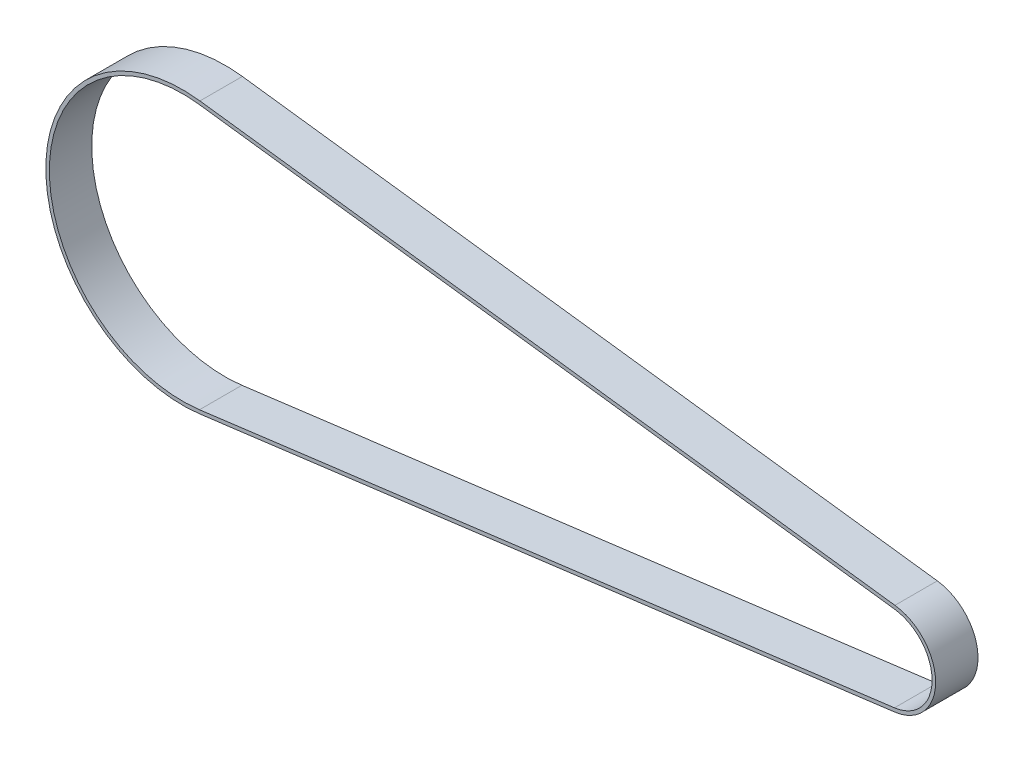
ISO-10303-21;
HEADER;
FILE_DESCRIPTION(('STEP AP214'),'2;1');
FILE_NAME('part.step','',(''),(''),'','','');
FILE_SCHEMA(('AUTOMOTIVE_DESIGN { 1 0 10303 214 1 1 1 1 }'));
ENDSEC;
DATA;
#1=APPLICATION_CONTEXT('core data for automotive mechanical design processes');
#2=APPLICATION_PROTOCOL_DEFINITION('international standard','automotive_design',2000,#1);
#3=PRODUCT_CONTEXT('',#1,'mechanical');
#4=PRODUCT('Part','Part','',(#3));
#5=PRODUCT_RELATED_PRODUCT_CATEGORY('part','',(#4));
#6=PRODUCT_DEFINITION_FORMATION('','',#4);
#7=PRODUCT_DEFINITION_CONTEXT('part definition',#1,'design');
#8=PRODUCT_DEFINITION('design','',#6,#7);
#9=PRODUCT_DEFINITION_SHAPE('','',#8);
#10=(LENGTH_UNIT() NAMED_UNIT(*) SI_UNIT(.MILLI.,.METRE.));
#11=(NAMED_UNIT(*) PLANE_ANGLE_UNIT() SI_UNIT($,.RADIAN.));
#12=(NAMED_UNIT(*) SI_UNIT($,.STERADIAN.) SOLID_ANGLE_UNIT());
#13=UNCERTAINTY_MEASURE_WITH_UNIT(LENGTH_MEASURE(1.E-05),#10,'distance_accuracy_value','');
#14=(GEOMETRIC_REPRESENTATION_CONTEXT(3) GLOBAL_UNCERTAINTY_ASSIGNED_CONTEXT((#13)) GLOBAL_UNIT_ASSIGNED_CONTEXT((#10,
#11,#12)) REPRESENTATION_CONTEXT('',''));
#15=CARTESIAN_POINT('',(0.,0.,0.));
#16=DIRECTION('',(0.,0.,1.));
#17=DIRECTION('',(1.,0.,0.));
#18=AXIS2_PLACEMENT_3D('',#15,#16,#17);
#19=CARTESIAN_POINT('',(0.,0.,6.));
#20=DIRECTION('',(0.,0.,1.));
#21=DIRECTION('',(1.,0.,0.));
#22=AXIS2_PLACEMENT_3D('',#19,#20,#21);
#23=PLANE('',#22);
#24=CARTESIAN_POINT('',(0.,0.,6.));
#25=DIRECTION('',(0.,0.,1.));
#26=DIRECTION('',(1.,0.,0.));
#27=AXIS2_PLACEMENT_3D('',#24,#25,#26);
#28=CIRCLE('',#27,19.35);
#29=CARTESIAN_POINT('',(2.467125,19.1920763398434,6.));
#30=VERTEX_POINT('',#29);
#31=CARTESIAN_POINT('',(2.46712499999999,-19.1920763398434,6.));
#32=VERTEX_POINT('',#31);
#33=EDGE_CURVE('E136',#30,#32,#28,.T.);
#34=ORIENTED_EDGE('',*,*,#33,.T.);
#35=DIRECTION('',(0.99183857053454,0.1275,0.));
#36=VECTOR('',#35,1.);
#37=CARTESIAN_POINT('',(100.8415,-6.54613456552797,6.));
#38=LINE('',#37,#36);
#39=CARTESIAN_POINT('',(100.8415,-6.54613456552796,6.));
#40=VERTEX_POINT('',#39);
#41=EDGE_CURVE('E139',#32,#40,#38,.T.);
#42=ORIENTED_EDGE('',*,*,#41,.T.);
#43=CARTESIAN_POINT('',(100.,0.,6.));
#44=DIRECTION('',(0.,0.,1.));
#45=DIRECTION('',(1.,0.,0.));
#46=AXIS2_PLACEMENT_3D('',#43,#44,#45);
#47=CIRCLE('',#46,6.6);
#48=CARTESIAN_POINT('',(100.8415,6.54613456552796,6.));
#49=VERTEX_POINT('',#48);
#50=EDGE_CURVE('E142',#40,#49,#47,.T.);
#51=ORIENTED_EDGE('',*,*,#50,.T.);
#52=DIRECTION('',(-0.99183857053454,0.1275,0.));
#53=VECTOR('',#52,1.);
#54=CARTESIAN_POINT('',(2.467125,19.1920763398434,6.));
#55=LINE('',#54,#53);
#56=EDGE_CURVE('E144',#49,#30,#55,.T.);
#57=ORIENTED_EDGE('',*,*,#56,.T.);
#58=EDGE_LOOP('',(#34,#42,#51,#57));
#59=FACE_BOUND('',#58,.T.);
#60=DIRECTION('',(0.99183857053454,0.1275,0.));
#61=VECTOR('',#60,1.);
#62=CARTESIAN_POINT('',(100.77775,-6.05021528026069,6.));
#63=LINE('',#62,#61);
#64=CARTESIAN_POINT('',(2.403375,-18.6961570545761,6.));
#65=VERTEX_POINT('',#64);
#66=CARTESIAN_POINT('',(100.77775,-6.05021528026069,6.));
#67=VERTEX_POINT('',#66);
#68=EDGE_CURVE('E108',#65,#67,#63,.T.);
#69=ORIENTED_EDGE('',*,*,#68,.F.);
#70=CARTESIAN_POINT('',(0.,0.,6.));
#71=DIRECTION('',(0.,0.,1.));
#72=DIRECTION('',(1.,0.,0.));
#73=AXIS2_PLACEMENT_3D('',#70,#71,#72);
#74=CIRCLE('',#73,18.85);
#75=CARTESIAN_POINT('',(2.403375,18.6961570545761,6.));
#76=VERTEX_POINT('',#75);
#77=EDGE_CURVE('E100',#76,#65,#74,.T.);
#78=ORIENTED_EDGE('',*,*,#77,.F.);
#79=DIRECTION('',(-0.99183857053454,0.1275,0.));
#80=VECTOR('',#79,1.);
#81=CARTESIAN_POINT('',(2.403375,18.6961570545761,6.));
#82=LINE('',#81,#80);
#83=CARTESIAN_POINT('',(100.77775,6.05021528026069,6.));
#84=VERTEX_POINT('',#83);
#85=EDGE_CURVE('E122',#84,#76,#82,.T.);
#86=ORIENTED_EDGE('',*,*,#85,.F.);
#87=CARTESIAN_POINT('',(100.,0.,6.));
#88=DIRECTION('',(0.,0.,1.));
#89=DIRECTION('',(1.,0.,0.));
#90=AXIS2_PLACEMENT_3D('',#87,#88,#89);
#91=CIRCLE('',#90,6.1);
#92=EDGE_CURVE('E120',#67,#84,#91,.T.);
#93=ORIENTED_EDGE('',*,*,#92,.F.);
#94=EDGE_LOOP('',(#69,#78,#86,#93));
#95=FACE_BOUND('',#94,.T.);
#96=ADVANCED_FACE('F35',(#59,#95),#23,.T.);
#97=CARTESIAN_POINT('',(0.,0.,0.));
#98=DIRECTION('',(0.,0.,1.));
#99=DIRECTION('',(1.,0.,0.));
#100=AXIS2_PLACEMENT_3D('',#97,#98,#99);
#101=PLANE('',#100);
#102=CARTESIAN_POINT('',(0.,0.,0.));
#103=DIRECTION('',(0.,0.,1.));
#104=DIRECTION('',(1.,0.,0.));
#105=AXIS2_PLACEMENT_3D('',#102,#103,#104);
#106=CIRCLE('',#105,19.35);
#107=CARTESIAN_POINT('',(2.467125,19.1920763398434,0.));
#108=VERTEX_POINT('',#107);
#109=CARTESIAN_POINT('',(2.46712499999999,-19.1920763398434,0.));
#110=VERTEX_POINT('',#109);
#111=EDGE_CURVE('E116',#108,#110,#106,.T.);
#112=ORIENTED_EDGE('',*,*,#111,.F.);
#113=DIRECTION('',(-0.99183857053454,0.1275,0.));
#114=VECTOR('',#113,1.);
#115=CARTESIAN_POINT('',(2.467125,19.1920763398434,0.));
#116=LINE('',#115,#114);
#117=CARTESIAN_POINT('',(100.8415,6.54613456552796,0.));
#118=VERTEX_POINT('',#117);
#119=EDGE_CURVE('E140',#118,#108,#116,.T.);
#120=ORIENTED_EDGE('',*,*,#119,.F.);
#121=CARTESIAN_POINT('',(100.,0.,0.));
#122=DIRECTION('',(0.,0.,1.));
#123=DIRECTION('',(1.,0.,0.));
#124=AXIS2_PLACEMENT_3D('',#121,#122,#123);
#125=CIRCLE('',#124,6.6);
#126=CARTESIAN_POINT('',(100.8415,-6.54613456552796,0.));
#127=VERTEX_POINT('',#126);
#128=EDGE_CURVE('E151',#127,#118,#125,.T.);
#129=ORIENTED_EDGE('',*,*,#128,.F.);
#130=DIRECTION('',(0.99183857053454,0.1275,0.));
#131=VECTOR('',#130,1.);
#132=CARTESIAN_POINT('',(100.8415,-6.54613456552797,0.));
#133=LINE('',#132,#131);
#134=EDGE_CURVE('E149',#110,#127,#133,.T.);
#135=ORIENTED_EDGE('',*,*,#134,.F.);
#136=EDGE_LOOP('',(#112,#120,#129,#135));
#137=FACE_BOUND('',#136,.T.);
#138=CARTESIAN_POINT('',(0.,0.,0.));
#139=DIRECTION('',(0.,0.,1.));
#140=DIRECTION('',(1.,0.,0.));
#141=AXIS2_PLACEMENT_3D('',#138,#139,#140);
#142=CIRCLE('',#141,18.85);
#143=CARTESIAN_POINT('',(2.403375,18.6961570545761,0.));
#144=VERTEX_POINT('',#143);
#145=CARTESIAN_POINT('',(2.403375,-18.6961570545761,0.));
#146=VERTEX_POINT('',#145);
#147=EDGE_CURVE('E58',#144,#146,#142,.T.);
#148=ORIENTED_EDGE('',*,*,#147,.T.);
#149=DIRECTION('',(0.99183857053454,0.1275,0.));
#150=VECTOR('',#149,1.);
#151=CARTESIAN_POINT('',(100.77775,-6.05021528026069,0.));
#152=LINE('',#151,#150);
#153=CARTESIAN_POINT('',(100.77775,-6.05021528026069,0.));
#154=VERTEX_POINT('',#153);
#155=EDGE_CURVE('E115',#146,#154,#152,.T.);
#156=ORIENTED_EDGE('',*,*,#155,.T.);
#157=CARTESIAN_POINT('',(100.,0.,0.));
#158=DIRECTION('',(0.,0.,1.));
#159=DIRECTION('',(1.,0.,0.));
#160=AXIS2_PLACEMENT_3D('',#157,#158,#159);
#161=CIRCLE('',#160,6.1);
#162=CARTESIAN_POINT('',(100.77775,6.05021528026069,0.));
#163=VERTEX_POINT('',#162);
#164=EDGE_CURVE('E128',#154,#163,#161,.T.);
#165=ORIENTED_EDGE('',*,*,#164,.T.);
#166=DIRECTION('',(-0.99183857053454,0.1275,0.));
#167=VECTOR('',#166,1.);
#168=CARTESIAN_POINT('',(2.403375,18.6961570545761,0.));
#169=LINE('',#168,#167);
#170=EDGE_CURVE('E109',#163,#144,#169,.T.);
#171=ORIENTED_EDGE('',*,*,#170,.T.);
#172=EDGE_LOOP('',(#148,#156,#165,#171));
#173=FACE_BOUND('',#172,.T.);
#174=ADVANCED_FACE('F169',(#137,#173),#101,.F.);
#175=CARTESIAN_POINT('',(0.,0.,6.));
#176=DIRECTION('',(0.,0.,-1.));
#177=DIRECTION('',(-1.,0.,0.));
#178=AXIS2_PLACEMENT_3D('',#175,#176,#177);
#179=CYLINDRICAL_SURFACE('',#178,19.35);
#180=ORIENTED_EDGE('',*,*,#111,.T.);
#181=DIRECTION('',(0.,0.,-1.));
#182=VECTOR('',#181,1.);
#183=CARTESIAN_POINT('',(2.46712499999999,-19.1920763398434,6.));
#184=LINE('',#183,#182);
#185=EDGE_CURVE('E11',#32,#110,#184,.T.);
#186=ORIENTED_EDGE('',*,*,#185,.F.);
#187=ORIENTED_EDGE('',*,*,#33,.F.);
#188=DIRECTION('',(0.,0.,-1.));
#189=VECTOR('',#188,1.);
#190=CARTESIAN_POINT('',(2.467125,19.1920763398434,6.));
#191=LINE('',#190,#189);
#192=EDGE_CURVE('E146',#30,#108,#191,.T.);
#193=ORIENTED_EDGE('',*,*,#192,.T.);
#194=EDGE_LOOP('',(#180,#186,#187,#193));
#195=FACE_BOUND('',#194,.T.);
#196=ADVANCED_FACE('F37',(#195),#179,.T.);
#197=CARTESIAN_POINT('',(100.8415,-6.54613456552797,6.));
#198=DIRECTION('',(-0.1275,0.99183857053454,0.));
#199=DIRECTION('',(-0.99183857053454,-0.1275,0.));
#200=AXIS2_PLACEMENT_3D('',#197,#198,#199);
#201=PLANE('',#200);
#202=ORIENTED_EDGE('',*,*,#134,.T.);
#203=DIRECTION('',(0.,0.,-1.));
#204=VECTOR('',#203,1.);
#205=CARTESIAN_POINT('',(100.8415,-6.54613456552796,6.));
#206=LINE('',#205,#204);
#207=EDGE_CURVE('E43',#40,#127,#206,.T.);
#208=ORIENTED_EDGE('',*,*,#207,.F.);
#209=ORIENTED_EDGE('',*,*,#41,.F.);
#210=ORIENTED_EDGE('',*,*,#185,.T.);
#211=EDGE_LOOP('',(#202,#208,#209,#210));
#212=FACE_BOUND('',#211,.T.);
#213=ADVANCED_FACE('F179',(#212),#201,.F.);
#214=CARTESIAN_POINT('',(100.,0.,6.));
#215=DIRECTION('',(0.,0.,-1.));
#216=DIRECTION('',(-1.,0.,0.));
#217=AXIS2_PLACEMENT_3D('',#214,#215,#216);
#218=CYLINDRICAL_SURFACE('',#217,6.6);
#219=ORIENTED_EDGE('',*,*,#128,.T.);
#220=DIRECTION('',(0.,0.,-1.));
#221=VECTOR('',#220,1.);
#222=CARTESIAN_POINT('',(100.8415,6.54613456552796,6.));
#223=LINE('',#222,#221);
#224=EDGE_CURVE('E156',#49,#118,#223,.T.);
#225=ORIENTED_EDGE('',*,*,#224,.F.);
#226=ORIENTED_EDGE('',*,*,#50,.F.);
#227=ORIENTED_EDGE('',*,*,#207,.T.);
#228=EDGE_LOOP('',(#219,#225,#226,#227));
#229=FACE_BOUND('',#228,.T.);
#230=ADVANCED_FACE('F163',(#229),#218,.T.);
#231=CARTESIAN_POINT('',(2.467125,19.1920763398434,6.));
#232=DIRECTION('',(-0.1275,-0.99183857053454,0.));
#233=DIRECTION('',(0.99183857053454,-0.1275,0.));
#234=AXIS2_PLACEMENT_3D('',#231,#232,#233);
#235=PLANE('',#234);
#236=ORIENTED_EDGE('',*,*,#119,.T.);
#237=ORIENTED_EDGE('',*,*,#192,.F.);
#238=ORIENTED_EDGE('',*,*,#56,.F.);
#239=ORIENTED_EDGE('',*,*,#224,.T.);
#240=EDGE_LOOP('',(#236,#237,#238,#239));
#241=FACE_BOUND('',#240,.T.);
#242=ADVANCED_FACE('F173',(#241),#235,.F.);
#243=CARTESIAN_POINT('',(0.,0.,6.));
#244=DIRECTION('',(0.,0.,-1.));
#245=DIRECTION('',(-1.,0.,0.));
#246=AXIS2_PLACEMENT_3D('',#243,#244,#245);
#247=CYLINDRICAL_SURFACE('',#246,18.85);
#248=ORIENTED_EDGE('',*,*,#147,.F.);
#249=DIRECTION('',(0.,0.,-1.));
#250=VECTOR('',#249,1.);
#251=CARTESIAN_POINT('',(2.403375,18.6961570545761,6.));
#252=LINE('',#251,#250);
#253=EDGE_CURVE('E104',#76,#144,#252,.T.);
#254=ORIENTED_EDGE('',*,*,#253,.F.);
#255=ORIENTED_EDGE('',*,*,#77,.T.);
#256=DIRECTION('',(0.,0.,-1.));
#257=VECTOR('',#256,1.);
#258=CARTESIAN_POINT('',(2.403375,-18.6961570545761,6.));
#259=LINE('',#258,#257);
#260=EDGE_CURVE('E103',#65,#146,#259,.T.);
#261=ORIENTED_EDGE('',*,*,#260,.T.);
#262=EDGE_LOOP('',(#248,#254,#255,#261));
#263=FACE_BOUND('',#262,.T.);
#264=ADVANCED_FACE('F102',(#263),#247,.F.);
#265=CARTESIAN_POINT('',(100.77775,-6.05021528026069,6.));
#266=DIRECTION('',(-0.1275,0.99183857053454,0.));
#267=DIRECTION('',(-0.99183857053454,-0.1275,0.));
#268=AXIS2_PLACEMENT_3D('',#265,#266,#267);
#269=PLANE('',#268);
#270=ORIENTED_EDGE('',*,*,#155,.F.);
#271=ORIENTED_EDGE('',*,*,#260,.F.);
#272=ORIENTED_EDGE('',*,*,#68,.T.);
#273=DIRECTION('',(0.,0.,-1.));
#274=VECTOR('',#273,1.);
#275=CARTESIAN_POINT('',(100.77775,-6.05021528026069,6.));
#276=LINE('',#275,#274);
#277=EDGE_CURVE('E117',#67,#154,#276,.T.);
#278=ORIENTED_EDGE('',*,*,#277,.T.);
#279=EDGE_LOOP('',(#270,#271,#272,#278));
#280=FACE_BOUND('',#279,.T.);
#281=ADVANCED_FACE('F112',(#280),#269,.T.);
#282=CARTESIAN_POINT('',(100.,0.,6.));
#283=DIRECTION('',(0.,0.,-1.));
#284=DIRECTION('',(-1.,0.,0.));
#285=AXIS2_PLACEMENT_3D('',#282,#283,#284);
#286=CYLINDRICAL_SURFACE('',#285,6.1);
#287=ORIENTED_EDGE('',*,*,#164,.F.);
#288=ORIENTED_EDGE('',*,*,#277,.F.);
#289=ORIENTED_EDGE('',*,*,#92,.T.);
#290=DIRECTION('',(0.,0.,-1.));
#291=VECTOR('',#290,1.);
#292=CARTESIAN_POINT('',(100.77775,6.05021528026069,6.));
#293=LINE('',#292,#291);
#294=EDGE_CURVE('E50',#84,#163,#293,.T.);
#295=ORIENTED_EDGE('',*,*,#294,.T.);
#296=EDGE_LOOP('',(#287,#288,#289,#295));
#297=FACE_BOUND('',#296,.T.);
#298=ADVANCED_FACE('F202',(#297),#286,.F.);
#299=CARTESIAN_POINT('',(2.403375,18.6961570545761,6.));
#300=DIRECTION('',(-0.1275,-0.99183857053454,0.));
#301=DIRECTION('',(0.99183857053454,-0.1275,0.));
#302=AXIS2_PLACEMENT_3D('',#299,#300,#301);
#303=PLANE('',#302);
#304=ORIENTED_EDGE('',*,*,#170,.F.);
#305=ORIENTED_EDGE('',*,*,#294,.F.);
#306=ORIENTED_EDGE('',*,*,#85,.T.);
#307=ORIENTED_EDGE('',*,*,#253,.T.);
#308=EDGE_LOOP('',(#304,#305,#306,#307));
#309=FACE_BOUND('',#308,.T.);
#310=ADVANCED_FACE('F206',(#309),#303,.T.);
#311=CLOSED_SHELL('',(#96,#174,#196,#213,#230,#242,#264,#281,#298,#310));
#312=MANIFOLD_SOLID_BREP('B2',#311);
#313=ADVANCED_BREP_SHAPE_REPRESENTATION('',(#18,#312),#14);
#314=SHAPE_DEFINITION_REPRESENTATION(#9,#313);
ENDSEC;
END-ISO-10303-21;
